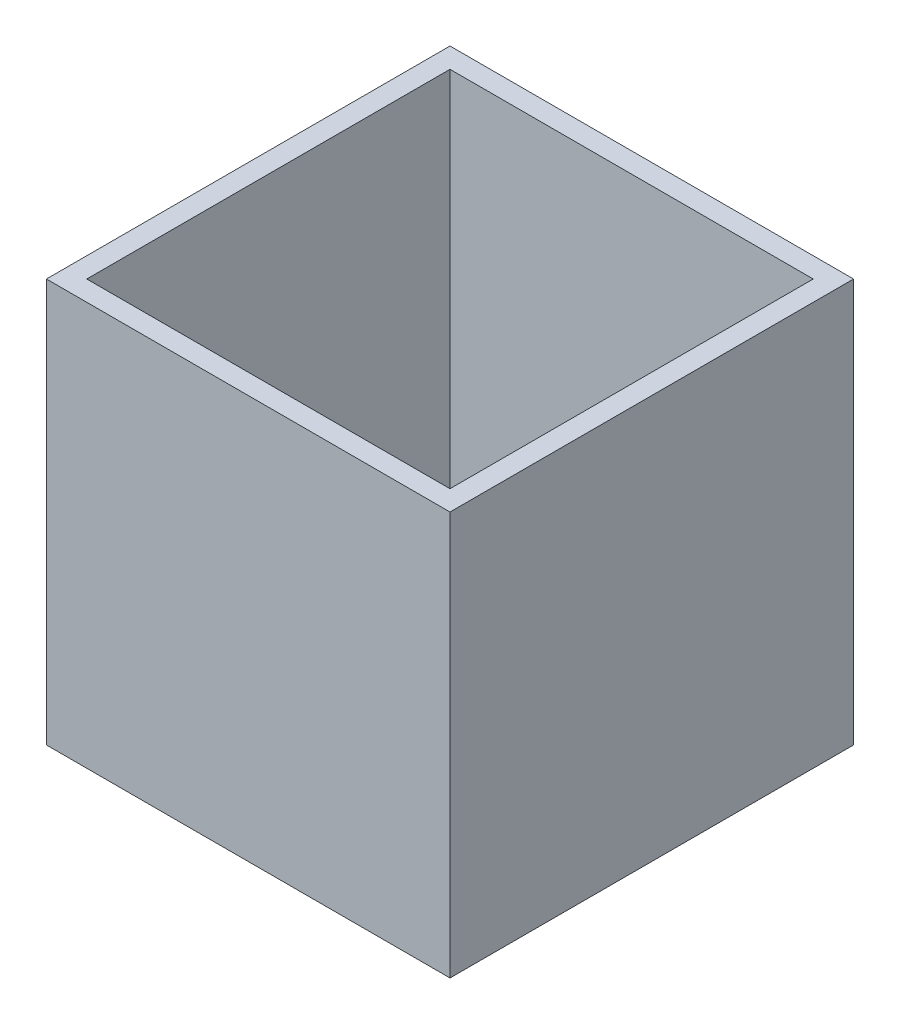
ISO-10303-21;
HEADER;
FILE_DESCRIPTION(('STEP AP214'),'2;1');
FILE_NAME('part.step','',(''),(''),'','','');
FILE_SCHEMA(('AUTOMOTIVE_DESIGN { 1 0 10303 214 1 1 1 1 }'));
ENDSEC;
DATA;
#1=APPLICATION_CONTEXT('core data for automotive mechanical design processes');
#2=APPLICATION_PROTOCOL_DEFINITION('international standard','automotive_design',2000,#1);
#3=PRODUCT_CONTEXT('',#1,'mechanical');
#4=PRODUCT('Part','Part','',(#3));
#5=PRODUCT_RELATED_PRODUCT_CATEGORY('part','',(#4));
#6=PRODUCT_DEFINITION_FORMATION('','',#4);
#7=PRODUCT_DEFINITION_CONTEXT('part definition',#1,'design');
#8=PRODUCT_DEFINITION('design','',#6,#7);
#9=PRODUCT_DEFINITION_SHAPE('','',#8);
#10=(LENGTH_UNIT() NAMED_UNIT(*) SI_UNIT(.MILLI.,.METRE.));
#11=(NAMED_UNIT(*) PLANE_ANGLE_UNIT() SI_UNIT($,.RADIAN.));
#12=(NAMED_UNIT(*) SI_UNIT($,.STERADIAN.) SOLID_ANGLE_UNIT());
#13=UNCERTAINTY_MEASURE_WITH_UNIT(LENGTH_MEASURE(1.E-05),#10,'distance_accuracy_value','');
#14=(GEOMETRIC_REPRESENTATION_CONTEXT(3) GLOBAL_UNCERTAINTY_ASSIGNED_CONTEXT((#13)) GLOBAL_UNIT_ASSIGNED_CONTEXT((#10,
#11,#12)) REPRESENTATION_CONTEXT('',''));
#15=CARTESIAN_POINT('',(0.,0.,0.));
#16=DIRECTION('',(0.,0.,1.));
#17=DIRECTION('',(1.,0.,0.));
#18=AXIS2_PLACEMENT_3D('',#15,#16,#17);
#19=CARTESIAN_POINT('',(0.,40.,0.));
#20=DIRECTION('',(0.,1.,0.));
#21=DIRECTION('',(0.,0.,1.));
#22=AXIS2_PLACEMENT_3D('',#19,#20,#21);
#23=PLANE('',#22);
#24=DIRECTION('',(0.,0.,1.));
#25=VECTOR('',#24,1.);
#26=CARTESIAN_POINT('',(-20.,40.,20.));
#27=LINE('',#26,#25);
#28=CARTESIAN_POINT('',(-20.,40.,-20.));
#29=VERTEX_POINT('',#28);
#30=CARTESIAN_POINT('',(-20.,40.,20.));
#31=VERTEX_POINT('',#30);
#32=EDGE_CURVE('E160',#29,#31,#27,.T.);
#33=ORIENTED_EDGE('',*,*,#32,.T.);
#34=DIRECTION('',(1.,0.,0.));
#35=VECTOR('',#34,1.);
#36=CARTESIAN_POINT('',(20.,40.,20.));
#37=LINE('',#36,#35);
#38=CARTESIAN_POINT('',(20.,40.,20.));
#39=VERTEX_POINT('',#38);
#40=EDGE_CURVE('E163',#31,#39,#37,.T.);
#41=ORIENTED_EDGE('',*,*,#40,.T.);
#42=DIRECTION('',(0.,0.,-1.));
#43=VECTOR('',#42,1.);
#44=CARTESIAN_POINT('',(20.,40.,20.));
#45=LINE('',#44,#43);
#46=CARTESIAN_POINT('',(20.,40.,-20.));
#47=VERTEX_POINT('',#46);
#48=EDGE_CURVE('E166',#39,#47,#45,.T.);
#49=ORIENTED_EDGE('',*,*,#48,.T.);
#50=DIRECTION('',(-1.,0.,0.));
#51=VECTOR('',#50,1.);
#52=CARTESIAN_POINT('',(20.,40.,-20.));
#53=LINE('',#52,#51);
#54=EDGE_CURVE('E168',#47,#29,#53,.T.);
#55=ORIENTED_EDGE('',*,*,#54,.T.);
#56=EDGE_LOOP('',(#33,#41,#49,#55));
#57=FACE_BOUND('',#56,.T.);
#58=DIRECTION('',(1.,0.,0.));
#59=VECTOR('',#58,1.);
#60=CARTESIAN_POINT('',(20.,40.,18.));
#61=LINE('',#60,#59);
#62=CARTESIAN_POINT('',(-18.,40.,18.));
#63=VERTEX_POINT('',#62);
#64=CARTESIAN_POINT('',(18.,40.,18.));
#65=VERTEX_POINT('',#64);
#66=EDGE_CURVE('E132',#63,#65,#61,.T.);
#67=ORIENTED_EDGE('',*,*,#66,.F.);
#68=DIRECTION('',(0.,0.,1.));
#69=VECTOR('',#68,1.);
#70=CARTESIAN_POINT('',(-18.,40.,20.));
#71=LINE('',#70,#69);
#72=CARTESIAN_POINT('',(-18.,40.,-18.));
#73=VERTEX_POINT('',#72);
#74=EDGE_CURVE('E124',#73,#63,#71,.T.);
#75=ORIENTED_EDGE('',*,*,#74,.F.);
#76=DIRECTION('',(-1.,0.,0.));
#77=VECTOR('',#76,1.);
#78=CARTESIAN_POINT('',(20.,40.,-18.));
#79=LINE('',#78,#77);
#80=CARTESIAN_POINT('',(18.,40.,-18.));
#81=VERTEX_POINT('',#80);
#82=EDGE_CURVE('E146',#81,#73,#79,.T.);
#83=ORIENTED_EDGE('',*,*,#82,.F.);
#84=DIRECTION('',(0.,0.,-1.));
#85=VECTOR('',#84,1.);
#86=CARTESIAN_POINT('',(18.,40.,20.));
#87=LINE('',#86,#85);
#88=EDGE_CURVE('E144',#65,#81,#87,.T.);
#89=ORIENTED_EDGE('',*,*,#88,.F.);
#90=EDGE_LOOP('',(#67,#75,#83,#89));
#91=FACE_BOUND('',#90,.T.);
#92=ADVANCED_FACE('F59',(#57,#91),#23,.T.);
#93=CARTESIAN_POINT('',(0.,0.,0.));
#94=DIRECTION('',(0.,1.,0.));
#95=DIRECTION('',(0.,0.,1.));
#96=AXIS2_PLACEMENT_3D('',#93,#94,#95);
#97=PLANE('',#96);
#98=DIRECTION('',(0.,0.,1.));
#99=VECTOR('',#98,1.);
#100=CARTESIAN_POINT('',(-20.,0.,20.));
#101=LINE('',#100,#99);
#102=CARTESIAN_POINT('',(-20.,0.,-20.));
#103=VERTEX_POINT('',#102);
#104=CARTESIAN_POINT('',(-20.,0.,20.));
#105=VERTEX_POINT('',#104);
#106=EDGE_CURVE('E140',#103,#105,#101,.T.);
#107=ORIENTED_EDGE('',*,*,#106,.F.);
#108=DIRECTION('',(-1.,0.,0.));
#109=VECTOR('',#108,1.);
#110=CARTESIAN_POINT('',(20.,0.,-20.));
#111=LINE('',#110,#109);
#112=CARTESIAN_POINT('',(20.,0.,-20.));
#113=VERTEX_POINT('',#112);
#114=EDGE_CURVE('E164',#113,#103,#111,.T.);
#115=ORIENTED_EDGE('',*,*,#114,.F.);
#116=DIRECTION('',(0.,0.,-1.));
#117=VECTOR('',#116,1.);
#118=CARTESIAN_POINT('',(20.,0.,20.));
#119=LINE('',#118,#117);
#120=CARTESIAN_POINT('',(20.,0.,20.));
#121=VERTEX_POINT('',#120);
#122=EDGE_CURVE('E175',#121,#113,#119,.T.);
#123=ORIENTED_EDGE('',*,*,#122,.F.);
#124=DIRECTION('',(1.,0.,0.));
#125=VECTOR('',#124,1.);
#126=CARTESIAN_POINT('',(20.,0.,20.));
#127=LINE('',#126,#125);
#128=EDGE_CURVE('E173',#105,#121,#127,.T.);
#129=ORIENTED_EDGE('',*,*,#128,.F.);
#130=EDGE_LOOP('',(#107,#115,#123,#129));
#131=FACE_BOUND('',#130,.T.);
#132=DIRECTION('',(0.,0.,1.));
#133=VECTOR('',#132,1.);
#134=CARTESIAN_POINT('',(-18.,0.,20.));
#135=LINE('',#134,#133);
#136=CARTESIAN_POINT('',(-18.,0.,-18.));
#137=VERTEX_POINT('',#136);
#138=CARTESIAN_POINT('',(-18.,0.,18.));
#139=VERTEX_POINT('',#138);
#140=EDGE_CURVE('E82',#137,#139,#135,.T.);
#141=ORIENTED_EDGE('',*,*,#140,.T.);
#142=DIRECTION('',(1.,0.,0.));
#143=VECTOR('',#142,1.);
#144=CARTESIAN_POINT('',(20.,0.,18.));
#145=LINE('',#144,#143);
#146=CARTESIAN_POINT('',(18.,0.,18.));
#147=VERTEX_POINT('',#146);
#148=EDGE_CURVE('E139',#139,#147,#145,.T.);
#149=ORIENTED_EDGE('',*,*,#148,.T.);
#150=DIRECTION('',(0.,0.,-1.));
#151=VECTOR('',#150,1.);
#152=CARTESIAN_POINT('',(18.,0.,20.));
#153=LINE('',#152,#151);
#154=CARTESIAN_POINT('',(18.,0.,-18.));
#155=VERTEX_POINT('',#154);
#156=EDGE_CURVE('E152',#147,#155,#153,.T.);
#157=ORIENTED_EDGE('',*,*,#156,.T.);
#158=DIRECTION('',(-1.,0.,0.));
#159=VECTOR('',#158,1.);
#160=CARTESIAN_POINT('',(20.,0.,-18.));
#161=LINE('',#160,#159);
#162=EDGE_CURVE('E133',#155,#137,#161,.T.);
#163=ORIENTED_EDGE('',*,*,#162,.T.);
#164=EDGE_LOOP('',(#141,#149,#157,#163));
#165=FACE_BOUND('',#164,.T.);
#166=ADVANCED_FACE('F193',(#131,#165),#97,.F.);
#167=CARTESIAN_POINT('',(-20.,40.,20.));
#168=DIRECTION('',(1.,0.,0.));
#169=DIRECTION('',(0.,0.,-1.));
#170=AXIS2_PLACEMENT_3D('',#167,#168,#169);
#171=PLANE('',#170);
#172=ORIENTED_EDGE('',*,*,#106,.T.);
#173=DIRECTION('',(0.,-1.,0.));
#174=VECTOR('',#173,1.);
#175=CARTESIAN_POINT('',(-20.,40.,20.));
#176=LINE('',#175,#174);
#177=EDGE_CURVE('E12',#31,#105,#176,.T.);
#178=ORIENTED_EDGE('',*,*,#177,.F.);
#179=ORIENTED_EDGE('',*,*,#32,.F.);
#180=DIRECTION('',(0.,-1.,0.));
#181=VECTOR('',#180,1.);
#182=CARTESIAN_POINT('',(-20.,40.,-20.));
#183=LINE('',#182,#181);
#184=EDGE_CURVE('E170',#29,#103,#183,.T.);
#185=ORIENTED_EDGE('',*,*,#184,.T.);
#186=EDGE_LOOP('',(#172,#178,#179,#185));
#187=FACE_BOUND('',#186,.T.);
#188=ADVANCED_FACE('F61',(#187),#171,.F.);
#189=CARTESIAN_POINT('',(20.,40.,20.));
#190=DIRECTION('',(0.,0.,-1.));
#191=DIRECTION('',(-1.,0.,0.));
#192=AXIS2_PLACEMENT_3D('',#189,#190,#191);
#193=PLANE('',#192);
#194=ORIENTED_EDGE('',*,*,#128,.T.);
#195=DIRECTION('',(0.,-1.,0.));
#196=VECTOR('',#195,1.);
#197=CARTESIAN_POINT('',(20.,40.,20.));
#198=LINE('',#197,#196);
#199=EDGE_CURVE('E67',#39,#121,#198,.T.);
#200=ORIENTED_EDGE('',*,*,#199,.F.);
#201=ORIENTED_EDGE('',*,*,#40,.F.);
#202=ORIENTED_EDGE('',*,*,#177,.T.);
#203=EDGE_LOOP('',(#194,#200,#201,#202));
#204=FACE_BOUND('',#203,.T.);
#205=ADVANCED_FACE('F203',(#204),#193,.F.);
#206=CARTESIAN_POINT('',(20.,40.,20.));
#207=DIRECTION('',(-1.,0.,0.));
#208=DIRECTION('',(0.,0.,1.));
#209=AXIS2_PLACEMENT_3D('',#206,#207,#208);
#210=PLANE('',#209);
#211=ORIENTED_EDGE('',*,*,#122,.T.);
#212=DIRECTION('',(0.,-1.,0.));
#213=VECTOR('',#212,1.);
#214=CARTESIAN_POINT('',(20.,40.,-20.));
#215=LINE('',#214,#213);
#216=EDGE_CURVE('E180',#47,#113,#215,.T.);
#217=ORIENTED_EDGE('',*,*,#216,.F.);
#218=ORIENTED_EDGE('',*,*,#48,.F.);
#219=ORIENTED_EDGE('',*,*,#199,.T.);
#220=EDGE_LOOP('',(#211,#217,#218,#219));
#221=FACE_BOUND('',#220,.T.);
#222=ADVANCED_FACE('F187',(#221),#210,.F.);
#223=CARTESIAN_POINT('',(20.,40.,-20.));
#224=DIRECTION('',(0.,0.,1.));
#225=DIRECTION('',(1.,0.,0.));
#226=AXIS2_PLACEMENT_3D('',#223,#224,#225);
#227=PLANE('',#226);
#228=ORIENTED_EDGE('',*,*,#114,.T.);
#229=ORIENTED_EDGE('',*,*,#184,.F.);
#230=ORIENTED_EDGE('',*,*,#54,.F.);
#231=ORIENTED_EDGE('',*,*,#216,.T.);
#232=EDGE_LOOP('',(#228,#229,#230,#231));
#233=FACE_BOUND('',#232,.T.);
#234=ADVANCED_FACE('F197',(#233),#227,.F.);
#235=CARTESIAN_POINT('',(-18.,40.,20.));
#236=DIRECTION('',(1.,0.,0.));
#237=DIRECTION('',(0.,0.,-1.));
#238=AXIS2_PLACEMENT_3D('',#235,#236,#237);
#239=PLANE('',#238);
#240=ORIENTED_EDGE('',*,*,#140,.F.);
#241=DIRECTION('',(0.,-1.,0.));
#242=VECTOR('',#241,1.);
#243=CARTESIAN_POINT('',(-18.,40.,-18.));
#244=LINE('',#243,#242);
#245=EDGE_CURVE('E128',#73,#137,#244,.T.);
#246=ORIENTED_EDGE('',*,*,#245,.F.);
#247=ORIENTED_EDGE('',*,*,#74,.T.);
#248=DIRECTION('',(0.,-1.,0.));
#249=VECTOR('',#248,1.);
#250=CARTESIAN_POINT('',(-18.,40.,18.));
#251=LINE('',#250,#249);
#252=EDGE_CURVE('E127',#63,#139,#251,.T.);
#253=ORIENTED_EDGE('',*,*,#252,.T.);
#254=EDGE_LOOP('',(#240,#246,#247,#253));
#255=FACE_BOUND('',#254,.T.);
#256=ADVANCED_FACE('F126',(#255),#239,.T.);
#257=CARTESIAN_POINT('',(20.,40.,18.));
#258=DIRECTION('',(0.,0.,-1.));
#259=DIRECTION('',(-1.,0.,0.));
#260=AXIS2_PLACEMENT_3D('',#257,#258,#259);
#261=PLANE('',#260);
#262=ORIENTED_EDGE('',*,*,#148,.F.);
#263=ORIENTED_EDGE('',*,*,#252,.F.);
#264=ORIENTED_EDGE('',*,*,#66,.T.);
#265=DIRECTION('',(0.,-1.,0.));
#266=VECTOR('',#265,1.);
#267=CARTESIAN_POINT('',(18.,40.,18.));
#268=LINE('',#267,#266);
#269=EDGE_CURVE('E141',#65,#147,#268,.T.);
#270=ORIENTED_EDGE('',*,*,#269,.T.);
#271=EDGE_LOOP('',(#262,#263,#264,#270));
#272=FACE_BOUND('',#271,.T.);
#273=ADVANCED_FACE('F136',(#272),#261,.T.);
#274=CARTESIAN_POINT('',(18.,40.,20.));
#275=DIRECTION('',(-1.,0.,0.));
#276=DIRECTION('',(0.,0.,1.));
#277=AXIS2_PLACEMENT_3D('',#274,#275,#276);
#278=PLANE('',#277);
#279=ORIENTED_EDGE('',*,*,#156,.F.);
#280=ORIENTED_EDGE('',*,*,#269,.F.);
#281=ORIENTED_EDGE('',*,*,#88,.T.);
#282=DIRECTION('',(0.,-1.,0.));
#283=VECTOR('',#282,1.);
#284=CARTESIAN_POINT('',(18.,40.,-18.));
#285=LINE('',#284,#283);
#286=EDGE_CURVE('E74',#81,#155,#285,.T.);
#287=ORIENTED_EDGE('',*,*,#286,.T.);
#288=EDGE_LOOP('',(#279,#280,#281,#287));
#289=FACE_BOUND('',#288,.T.);
#290=ADVANCED_FACE('F226',(#289),#278,.T.);
#291=CARTESIAN_POINT('',(20.,40.,-18.));
#292=DIRECTION('',(0.,0.,1.));
#293=DIRECTION('',(1.,0.,0.));
#294=AXIS2_PLACEMENT_3D('',#291,#292,#293);
#295=PLANE('',#294);
#296=ORIENTED_EDGE('',*,*,#162,.F.);
#297=ORIENTED_EDGE('',*,*,#286,.F.);
#298=ORIENTED_EDGE('',*,*,#82,.T.);
#299=ORIENTED_EDGE('',*,*,#245,.T.);
#300=EDGE_LOOP('',(#296,#297,#298,#299));
#301=FACE_BOUND('',#300,.T.);
#302=ADVANCED_FACE('F230',(#301),#295,.T.);
#303=CLOSED_SHELL('',(#92,#166,#188,#205,#222,#234,#256,#273,#290,#302));
#304=MANIFOLD_SOLID_BREP('B2',#303);
#305=ADVANCED_BREP_SHAPE_REPRESENTATION('',(#18,#304),#14);
#306=SHAPE_DEFINITION_REPRESENTATION(#9,#305);
ENDSEC;
END-ISO-10303-21;
